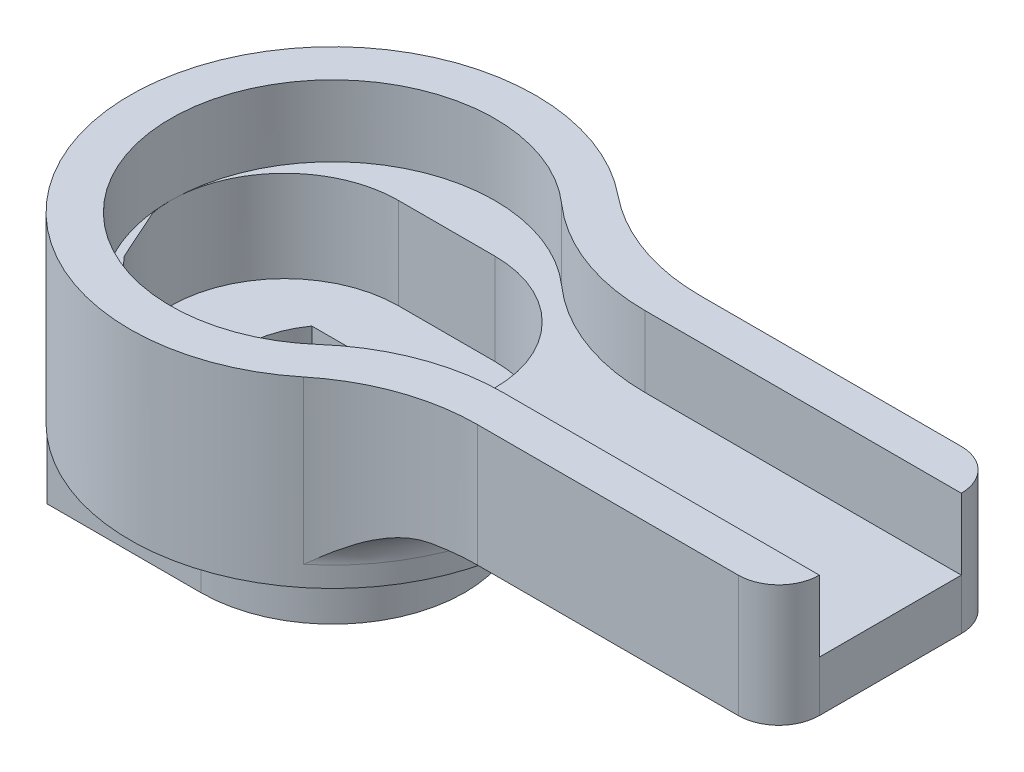
ISO-10303-21;
HEADER;
FILE_DESCRIPTION(('STEP AP214'),'2;1');
FILE_NAME('part.step','',(''),(''),'','','');
FILE_SCHEMA(('AUTOMOTIVE_DESIGN { 1 0 10303 214 1 1 1 1 }'));
ENDSEC;
DATA;
#1=APPLICATION_CONTEXT('core data for automotive mechanical design processes');
#2=APPLICATION_PROTOCOL_DEFINITION('international standard','automotive_design',2000,#1);
#3=PRODUCT_CONTEXT('',#1,'mechanical');
#4=PRODUCT('Part','Part','',(#3));
#5=PRODUCT_RELATED_PRODUCT_CATEGORY('part','',(#4));
#6=PRODUCT_DEFINITION_FORMATION('','',#4);
#7=PRODUCT_DEFINITION_CONTEXT('part definition',#1,'design');
#8=PRODUCT_DEFINITION('design','',#6,#7);
#9=PRODUCT_DEFINITION_SHAPE('','',#8);
#10=(LENGTH_UNIT() NAMED_UNIT(*) SI_UNIT(.MILLI.,.METRE.));
#11=(NAMED_UNIT(*) PLANE_ANGLE_UNIT() SI_UNIT($,.RADIAN.));
#12=(NAMED_UNIT(*) SI_UNIT($,.STERADIAN.) SOLID_ANGLE_UNIT());
#13=UNCERTAINTY_MEASURE_WITH_UNIT(LENGTH_MEASURE(1.E-05),#10,'distance_accuracy_value','');
#14=(GEOMETRIC_REPRESENTATION_CONTEXT(3) GLOBAL_UNCERTAINTY_ASSIGNED_CONTEXT((#13)) GLOBAL_UNIT_ASSIGNED_CONTEXT((#10,
#11,#12)) REPRESENTATION_CONTEXT('',''));
#15=CARTESIAN_POINT('',(0.,0.,0.));
#16=DIRECTION('',(0.,0.,1.));
#17=DIRECTION('',(1.,0.,0.));
#18=AXIS2_PLACEMENT_3D('',#15,#16,#17);
#19=CARTESIAN_POINT('',(0.,8.,0.));
#20=DIRECTION('',(0.,-1.,0.));
#21=DIRECTION('',(0.,0.,-1.));
#22=AXIS2_PLACEMENT_3D('',#19,#20,#21);
#23=CYLINDRICAL_SURFACE('',#22,6.5);
#24=DIRECTION('',(0.,1.,0.));
#25=VECTOR('',#24,1.);
#26=CARTESIAN_POINT('',(0.,-16.4012194668567,-6.5));
#27=LINE('',#26,#25);
#28=CARTESIAN_POINT('',(0.,0.,-6.5));
#29=VERTEX_POINT('',#28);
#30=CARTESIAN_POINT('',(0.,4.,-6.5));
#31=VERTEX_POINT('',#30);
#32=EDGE_CURVE('E250',#29,#31,#27,.T.);
#33=ORIENTED_EDGE('',*,*,#32,.T.);
#34=CARTESIAN_POINT('',(0.,4.,0.));
#35=DIRECTION('',(0.,1.,0.));
#36=DIRECTION('',(0.,0.,1.));
#37=AXIS2_PLACEMENT_3D('',#34,#35,#36);
#38=CIRCLE('',#37,6.5);
#39=CARTESIAN_POINT('',(0.,4.,6.5));
#40=VERTEX_POINT('',#39);
#41=EDGE_CURVE('E362',#40,#31,#38,.T.);
#42=ORIENTED_EDGE('',*,*,#41,.F.);
#43=DIRECTION('',(0.,1.,0.));
#44=VECTOR('',#43,1.);
#45=CARTESIAN_POINT('',(0.,-16.4012194668567,6.5));
#46=LINE('',#45,#44);
#47=CARTESIAN_POINT('',(0.,0.,6.5));
#48=VERTEX_POINT('',#47);
#49=EDGE_CURVE('E242',#48,#40,#46,.T.);
#50=ORIENTED_EDGE('',*,*,#49,.F.);
#51=CARTESIAN_POINT('',(0.,0.,0.));
#52=DIRECTION('',(0.,1.,0.));
#53=DIRECTION('',(0.,0.,1.));
#54=AXIS2_PLACEMENT_3D('',#51,#52,#53);
#55=CIRCLE('',#54,6.5);
#56=EDGE_CURVE('E227',#48,#29,#55,.T.);
#57=ORIENTED_EDGE('',*,*,#56,.T.);
#58=EDGE_LOOP('',(#33,#42,#50,#57));
#59=FACE_BOUND('',#58,.T.);
#60=ADVANCED_FACE('F35',(#59),#23,.T.);
#61=CARTESIAN_POINT('',(0.,4.,0.));
#62=DIRECTION('',(0.,1.,0.));
#63=DIRECTION('',(0.,0.,1.));
#64=AXIS2_PLACEMENT_3D('',#61,#62,#63);
#65=PLANE('',#64);
#66=DIRECTION('',(1.,0.,0.));
#67=VECTOR('',#66,1.);
#68=CARTESIAN_POINT('',(0.,4.,-6.5));
#69=LINE('',#68,#67);
#70=CARTESIAN_POINT('',(-7.59934207678533,4.,-6.5));
#71=VERTEX_POINT('',#70);
#72=EDGE_CURVE('E223',#71,#31,#69,.T.);
#73=ORIENTED_EDGE('',*,*,#72,.F.);
#74=CARTESIAN_POINT('',(0.,4.,0.));
#75=DIRECTION('',(0.,1.,0.));
#76=DIRECTION('',(0.,0.,1.));
#77=AXIS2_PLACEMENT_3D('',#74,#75,#76);
#78=CIRCLE('',#77,10.);
#79=CARTESIAN_POINT('',(-7.59934207678534,4.,6.5));
#80=VERTEX_POINT('',#79);
#81=EDGE_CURVE('E215',#80,#71,#78,.T.);
#82=ORIENTED_EDGE('',*,*,#81,.F.);
#83=DIRECTION('',(-1.,0.,0.));
#84=VECTOR('',#83,1.);
#85=CARTESIAN_POINT('',(0.,4.,6.5));
#86=LINE('',#85,#84);
#87=EDGE_CURVE('E220',#40,#80,#86,.T.);
#88=ORIENTED_EDGE('',*,*,#87,.F.);
#89=ORIENTED_EDGE('',*,*,#41,.T.);
#90=EDGE_LOOP('',(#73,#82,#88,#89));
#91=FACE_BOUND('',#90,.T.);
#92=ADVANCED_FACE('F217',(#91),#65,.F.);
#93=CARTESIAN_POINT('',(-5.03818391404763,8.,-2.625));
#94=DIRECTION('',(0.,0.,-1.));
#95=DIRECTION('',(-1.,0.,0.));
#96=AXIS2_PLACEMENT_3D('',#93,#94,#95);
#97=PLANE('',#96);
#98=DIRECTION('',(1.,0.,0.));
#99=VECTOR('',#98,1.);
#100=CARTESIAN_POINT('',(-5.03818391404763,5.,-2.625));
#101=LINE('',#100,#99);
#102=CARTESIAN_POINT('',(-3.65504787930336,5.,-2.625));
#103=VERTEX_POINT('',#102);
#104=CARTESIAN_POINT('',(3.65504787930336,5.,-2.625));
#105=VERTEX_POINT('',#104);
#106=EDGE_CURVE('E286',#103,#105,#101,.T.);
#107=ORIENTED_EDGE('',*,*,#106,.F.);
#108=DIRECTION('',(0.,-1.,0.));
#109=VECTOR('',#108,1.);
#110=CARTESIAN_POINT('',(-3.65504787930336,8.001,-2.625));
#111=LINE('',#110,#109);
#112=CARTESIAN_POINT('',(-3.65504787930336,0.,-2.625));
#113=VERTEX_POINT('',#112);
#114=EDGE_CURVE('E364',#113,#103,#111,.F.);
#115=ORIENTED_EDGE('',*,*,#114,.F.);
#116=DIRECTION('',(1.,0.,0.));
#117=VECTOR('',#116,1.);
#118=CARTESIAN_POINT('',(-5.03818391404763,0.,-2.625));
#119=LINE('',#118,#117);
#120=CARTESIAN_POINT('',(3.65504787930336,0.,-2.625));
#121=VERTEX_POINT('',#120);
#122=EDGE_CURVE('E351',#113,#121,#119,.T.);
#123=ORIENTED_EDGE('',*,*,#122,.T.);
#124=DIRECTION('',(0.,-1.,0.));
#125=VECTOR('',#124,1.);
#126=CARTESIAN_POINT('',(3.65504787930336,8.001,-2.625));
#127=LINE('',#126,#125);
#128=EDGE_CURVE('E367',#105,#121,#127,.T.);
#129=ORIENTED_EDGE('',*,*,#128,.F.);
#130=EDGE_LOOP('',(#107,#115,#123,#129));
#131=FACE_BOUND('',#130,.T.);
#132=ADVANCED_FACE('F473',(#131),#97,.F.);
#133=CARTESIAN_POINT('',(-5.03818391404763,8.,2.625));
#134=DIRECTION('',(0.,0.,1.));
#135=DIRECTION('',(1.,0.,0.));
#136=AXIS2_PLACEMENT_3D('',#133,#134,#135);
#137=PLANE('',#136);
#138=DIRECTION('',(-1.,0.,0.));
#139=VECTOR('',#138,1.);
#140=CARTESIAN_POINT('',(-5.03818391404763,5.,2.625));
#141=LINE('',#140,#139);
#142=CARTESIAN_POINT('',(3.65504787930336,5.,2.625));
#143=VERTEX_POINT('',#142);
#144=CARTESIAN_POINT('',(-3.65504787930336,5.,2.625));
#145=VERTEX_POINT('',#144);
#146=EDGE_CURVE('E279',#143,#145,#141,.T.);
#147=ORIENTED_EDGE('',*,*,#146,.F.);
#148=DIRECTION('',(0.,-1.,0.));
#149=VECTOR('',#148,1.);
#150=CARTESIAN_POINT('',(3.65504787930336,8.001,2.625));
#151=LINE('',#150,#149);
#152=CARTESIAN_POINT('',(3.65504787930336,0.,2.625));
#153=VERTEX_POINT('',#152);
#154=EDGE_CURVE('E345',#153,#143,#151,.F.);
#155=ORIENTED_EDGE('',*,*,#154,.F.);
#156=DIRECTION('',(-1.,0.,0.));
#157=VECTOR('',#156,1.);
#158=CARTESIAN_POINT('',(-5.03818391404763,0.,2.625));
#159=LINE('',#158,#157);
#160=CARTESIAN_POINT('',(-3.65504787930336,0.,2.625));
#161=VERTEX_POINT('',#160);
#162=EDGE_CURVE('E343',#153,#161,#159,.T.);
#163=ORIENTED_EDGE('',*,*,#162,.T.);
#164=DIRECTION('',(0.,-1.,0.));
#165=VECTOR('',#164,1.);
#166=CARTESIAN_POINT('',(-3.65504787930336,8.001,2.625));
#167=LINE('',#166,#165);
#168=EDGE_CURVE('E348',#145,#161,#167,.T.);
#169=ORIENTED_EDGE('',*,*,#168,.F.);
#170=EDGE_LOOP('',(#147,#155,#163,#169));
#171=FACE_BOUND('',#170,.T.);
#172=ADVANCED_FACE('F495',(#171),#137,.F.);
#173=CARTESIAN_POINT('',(0.,5.,0.));
#174=DIRECTION('',(0.,1.,0.));
#175=DIRECTION('',(0.,0.,1.));
#176=AXIS2_PLACEMENT_3D('',#173,#174,#175);
#177=PLANE('',#176);
#178=ORIENTED_EDGE('',*,*,#106,.T.);
#179=CARTESIAN_POINT('',(0.,5.,0.));
#180=DIRECTION('',(0.,1.,0.));
#181=DIRECTION('',(0.,0.,1.));
#182=AXIS2_PLACEMENT_3D('',#179,#180,#181);
#183=CIRCLE('',#182,4.5);
#184=EDGE_CURVE('E358',#143,#105,#183,.T.);
#185=ORIENTED_EDGE('',*,*,#184,.F.);
#186=ORIENTED_EDGE('',*,*,#146,.T.);
#187=EDGE_CURVE('E228',#103,#145,#183,.T.);
#188=ORIENTED_EDGE('',*,*,#187,.F.);
#189=EDGE_LOOP('',(#178,#185,#186,#188));
#190=FACE_BOUND('',#189,.T.);
#191=CARTESIAN_POINT('',(-2.375,5.,0.));
#192=DIRECTION('',(0.,1.,0.));
#193=DIRECTION('',(0.,0.,1.));
#194=AXIS2_PLACEMENT_3D('',#191,#192,#193);
#195=CIRCLE('',#194,5.625);
#196=CARTESIAN_POINT('',(-2.375,5.,-5.625));
#197=VERTEX_POINT('',#196);
#198=CARTESIAN_POINT('',(-2.375,5.,5.625));
#199=VERTEX_POINT('',#198);
#200=EDGE_CURVE('E253',#197,#199,#195,.T.);
#201=ORIENTED_EDGE('',*,*,#200,.T.);
#202=DIRECTION('',(1.,0.,0.));
#203=VECTOR('',#202,1.);
#204=CARTESIAN_POINT('',(-2.375,5.,5.625));
#205=LINE('',#204,#203);
#206=CARTESIAN_POINT('',(2.375,5.,5.625));
#207=VERTEX_POINT('',#206);
#208=EDGE_CURVE('E256',#199,#207,#205,.T.);
#209=ORIENTED_EDGE('',*,*,#208,.T.);
#210=CARTESIAN_POINT('',(2.375,5.,0.));
#211=DIRECTION('',(0.,1.,0.));
#212=DIRECTION('',(0.,0.,1.));
#213=AXIS2_PLACEMENT_3D('',#210,#211,#212);
#214=CIRCLE('',#213,5.625);
#215=CARTESIAN_POINT('',(2.375,5.,-5.625));
#216=VERTEX_POINT('',#215);
#217=EDGE_CURVE('E260',#207,#216,#214,.T.);
#218=ORIENTED_EDGE('',*,*,#217,.T.);
#219=DIRECTION('',(-1.,0.,0.));
#220=VECTOR('',#219,1.);
#221=CARTESIAN_POINT('',(-2.375,5.,-5.625));
#222=LINE('',#221,#220);
#223=EDGE_CURVE('E263',#216,#197,#222,.T.);
#224=ORIENTED_EDGE('',*,*,#223,.T.);
#225=EDGE_LOOP('',(#201,#209,#218,#224));
#226=FACE_BOUND('',#225,.T.);
#227=ADVANCED_FACE('F503',(#190,#226),#177,.T.);
#228=CARTESIAN_POINT('',(0.,8.001,0.));
#229=DIRECTION('',(0.,-1.,0.));
#230=DIRECTION('',(0.,0.,-1.));
#231=AXIS2_PLACEMENT_3D('',#228,#229,#230);
#232=CYLINDRICAL_SURFACE('',#231,4.5);
#233=ORIENTED_EDGE('',*,*,#187,.T.);
#234=ORIENTED_EDGE('',*,*,#168,.T.);
#235=CARTESIAN_POINT('',(0.,0.,0.));
#236=DIRECTION('',(0.,1.,0.));
#237=DIRECTION('',(0.,0.,1.));
#238=AXIS2_PLACEMENT_3D('',#235,#236,#237);
#239=CIRCLE('',#238,4.5);
#240=EDGE_CURVE('E355',#113,#161,#239,.T.);
#241=ORIENTED_EDGE('',*,*,#240,.F.);
#242=ORIENTED_EDGE('',*,*,#114,.T.);
#243=EDGE_LOOP('',(#233,#234,#241,#242));
#244=FACE_BOUND('',#243,.T.);
#245=ADVANCED_FACE('F491',(#244),#232,.F.);
#246=EDGE_CURVE('E354',#153,#121,#239,.T.);
#247=ORIENTED_EDGE('',*,*,#246,.F.);
#248=ORIENTED_EDGE('',*,*,#154,.T.);
#249=ORIENTED_EDGE('',*,*,#184,.T.);
#250=ORIENTED_EDGE('',*,*,#128,.T.);
#251=EDGE_LOOP('',(#247,#248,#249,#250));
#252=FACE_BOUND('',#251,.T.);
#253=ADVANCED_FACE('F486',(#252),#232,.F.);
#254=CARTESIAN_POINT('',(0.,0.,0.));
#255=DIRECTION('',(0.,1.,0.));
#256=DIRECTION('',(0.,0.,1.));
#257=AXIS2_PLACEMENT_3D('',#254,#255,#256);
#258=PLANE('',#257);
#259=ORIENTED_EDGE('',*,*,#56,.F.);
#260=DIRECTION('',(1.,0.,0.));
#261=VECTOR('',#260,1.);
#262=CARTESIAN_POINT('',(0.,0.,6.5));
#263=LINE('',#262,#261);
#264=CARTESIAN_POINT('',(-7.59934207678534,0.,6.5));
#265=VERTEX_POINT('',#264);
#266=EDGE_CURVE('E246',#265,#48,#263,.T.);
#267=ORIENTED_EDGE('',*,*,#266,.F.);
#268=CARTESIAN_POINT('',(0.,0.,0.));
#269=DIRECTION('',(0.,1.,0.));
#270=DIRECTION('',(0.,0.,1.));
#271=AXIS2_PLACEMENT_3D('',#268,#269,#270);
#272=CIRCLE('',#271,10.);
#273=CARTESIAN_POINT('',(-7.59934207678533,0.,-6.5));
#274=VERTEX_POINT('',#273);
#275=EDGE_CURVE('E234',#274,#265,#272,.T.);
#276=ORIENTED_EDGE('',*,*,#275,.F.);
#277=DIRECTION('',(-1.,0.,0.));
#278=VECTOR('',#277,1.);
#279=CARTESIAN_POINT('',(0.,0.,-6.5));
#280=LINE('',#279,#278);
#281=EDGE_CURVE('E237',#29,#274,#280,.T.);
#282=ORIENTED_EDGE('',*,*,#281,.F.);
#283=EDGE_LOOP('',(#259,#267,#276,#282));
#284=FACE_BOUND('',#283,.T.);
#285=ORIENTED_EDGE('',*,*,#240,.T.);
#286=ORIENTED_EDGE('',*,*,#162,.F.);
#287=ORIENTED_EDGE('',*,*,#246,.T.);
#288=ORIENTED_EDGE('',*,*,#122,.F.);
#289=EDGE_LOOP('',(#285,#286,#287,#288));
#290=FACE_BOUND('',#289,.T.);
#291=ADVANCED_FACE('F483',(#284,#290),#258,.F.);
#292=CARTESIAN_POINT('',(0.,4.,0.));
#293=DIRECTION('',(0.,1.,0.));
#294=DIRECTION('',(0.,0.,1.));
#295=AXIS2_PLACEMENT_3D('',#292,#293,#294);
#296=CYLINDRICAL_SURFACE('',#295,10.);
#297=CARTESIAN_POINT('',(0.,5.,0.));
#298=DIRECTION('',(0.,1.,0.));
#299=DIRECTION('',(0.,0.,1.));
#300=AXIS2_PLACEMENT_3D('',#297,#298,#299);
#301=CIRCLE('',#300,10.);
#302=CARTESIAN_POINT('',(6.31961232988227,5.,-7.75));
#303=VERTEX_POINT('',#302);
#304=CARTESIAN_POINT('',(6.31961232988227,5.,7.75));
#305=VERTEX_POINT('',#304);
#306=EDGE_CURVE('E427',#303,#305,#301,.F.);
#307=ORIENTED_EDGE('',*,*,#306,.T.);
#308=DIRECTION('',(0.,1.,0.));
#309=VECTOR('',#308,1.);
#310=CARTESIAN_POINT('',(6.31961232988227,4.,7.75));
#311=LINE('',#310,#309);
#312=CARTESIAN_POINT('',(6.31961232988227,13.,7.75));
#313=VERTEX_POINT('',#312);
#314=EDGE_CURVE('E375',#305,#313,#311,.T.);
#315=ORIENTED_EDGE('',*,*,#314,.T.);
#316=CARTESIAN_POINT('',(0.,13.,0.));
#317=DIRECTION('',(0.,1.,0.));
#318=DIRECTION('',(0.,0.,1.));
#319=AXIS2_PLACEMENT_3D('',#316,#317,#318);
#320=CIRCLE('',#319,10.);
#321=CARTESIAN_POINT('',(6.31961232988227,13.,-7.75));
#322=VERTEX_POINT('',#321);
#323=EDGE_CURVE('E337',#322,#313,#320,.T.);
#324=ORIENTED_EDGE('',*,*,#323,.F.);
#325=DIRECTION('',(0.,1.,0.));
#326=VECTOR('',#325,1.);
#327=CARTESIAN_POINT('',(6.31961232988227,4.,-7.75));
#328=LINE('',#327,#326);
#329=EDGE_CURVE('E373',#322,#303,#328,.F.);
#330=ORIENTED_EDGE('',*,*,#329,.T.);
#331=EDGE_LOOP('',(#307,#315,#324,#330));
#332=FACE_BOUND('',#331,.T.);
#333=ORIENTED_EDGE('',*,*,#81,.T.);
#334=DIRECTION('',(0.,1.,0.));
#335=VECTOR('',#334,1.);
#336=CARTESIAN_POINT('',(-7.59934207678533,-16.4012194668567,-6.5));
#337=LINE('',#336,#335);
#338=EDGE_CURVE('E238',#274,#71,#337,.T.);
#339=ORIENTED_EDGE('',*,*,#338,.F.);
#340=ORIENTED_EDGE('',*,*,#275,.T.);
#341=DIRECTION('',(0.,1.,0.));
#342=VECTOR('',#341,1.);
#343=CARTESIAN_POINT('',(-7.59934207678534,-16.4012194668567,6.5));
#344=LINE('',#343,#342);
#345=EDGE_CURVE('E232',#265,#80,#344,.T.);
#346=ORIENTED_EDGE('',*,*,#345,.T.);
#347=EDGE_LOOP('',(#333,#339,#340,#346));
#348=FACE_BOUND('',#347,.T.);
#349=ADVANCED_FACE('F233',(#332,#348),#296,.T.);
#350=CARTESIAN_POINT('',(0.,13.,0.));
#351=DIRECTION('',(0.,1.,0.));
#352=DIRECTION('',(0.,0.,1.));
#353=AXIS2_PLACEMENT_3D('',#350,#351,#352);
#354=PLANE('',#353);
#355=DIRECTION('',(1.,0.,0.));
#356=VECTOR('',#355,1.);
#357=CARTESIAN_POINT('',(27.5,13.,5.5));
#358=LINE('',#357,#356);
#359=CARTESIAN_POINT('',(12.6392246597645,13.,5.5));
#360=VERTEX_POINT('',#359);
#361=CARTESIAN_POINT('',(25.5,13.,5.5));
#362=VERTEX_POINT('',#361);
#363=EDGE_CURVE('E331',#360,#362,#358,.T.);
#364=ORIENTED_EDGE('',*,*,#363,.T.);
#365=CARTESIAN_POINT('',(25.5,13.,3.5));
#366=DIRECTION('',(0.,1.,0.));
#367=DIRECTION('',(0.,0.,1.));
#368=AXIS2_PLACEMENT_3D('',#365,#366,#367);
#369=CIRCLE('',#368,2.);
#370=CARTESIAN_POINT('',(27.5,13.,3.5));
#371=VERTEX_POINT('',#370);
#372=EDGE_CURVE('E411',#362,#371,#369,.T.);
#373=ORIENTED_EDGE('',*,*,#372,.T.);
#374=DIRECTION('',(1.,0.,0.));
#375=VECTOR('',#374,1.);
#376=CARTESIAN_POINT('',(29.1728965287241,13.,3.5));
#377=LINE('',#376,#375);
#378=CARTESIAN_POINT('',(11.9058808997907,13.,3.5));
#379=VERTEX_POINT('',#378);
#380=EDGE_CURVE('E305',#379,#371,#377,.T.);
#381=ORIENTED_EDGE('',*,*,#380,.F.);
#382=CARTESIAN_POINT('',(11.9058808997907,13.,13.5));
#383=DIRECTION('',(0.,1.,0.));
#384=DIRECTION('',(0.,0.,1.));
#385=AXIS2_PLACEMENT_3D('',#382,#383,#384);
#386=CIRCLE('',#385,10.);
#387=CARTESIAN_POINT('',(5.29150262212918,13.,6.));
#388=VERTEX_POINT('',#387);
#389=EDGE_CURVE('E390',#379,#388,#386,.T.);
#390=ORIENTED_EDGE('',*,*,#389,.T.);
#391=CARTESIAN_POINT('',(0.,13.,0.));
#392=DIRECTION('',(0.,1.,0.));
#393=DIRECTION('',(0.,0.,1.));
#394=AXIS2_PLACEMENT_3D('',#391,#392,#393);
#395=CIRCLE('',#394,8.);
#396=CARTESIAN_POINT('',(5.29150262212918,13.,-6.));
#397=VERTEX_POINT('',#396);
#398=EDGE_CURVE('E319',#397,#388,#395,.T.);
#399=ORIENTED_EDGE('',*,*,#398,.F.);
#400=CARTESIAN_POINT('',(11.9058808997907,13.,-13.5));
#401=DIRECTION('',(0.,1.,0.));
#402=DIRECTION('',(0.,0.,1.));
#403=AXIS2_PLACEMENT_3D('',#400,#401,#402);
#404=CIRCLE('',#403,10.);
#405=CARTESIAN_POINT('',(11.9058808997907,13.,-3.5));
#406=VERTEX_POINT('',#405);
#407=EDGE_CURVE('E388',#397,#406,#404,.T.);
#408=ORIENTED_EDGE('',*,*,#407,.T.);
#409=DIRECTION('',(-1.,0.,0.));
#410=VECTOR('',#409,1.);
#411=CARTESIAN_POINT('',(29.1728965287241,13.,-3.5));
#412=LINE('',#411,#410);
#413=CARTESIAN_POINT('',(27.5,13.,-3.5));
#414=VERTEX_POINT('',#413);
#415=EDGE_CURVE('E296',#414,#406,#412,.T.);
#416=ORIENTED_EDGE('',*,*,#415,.F.);
#417=CARTESIAN_POINT('',(25.5,13.,-3.5));
#418=DIRECTION('',(0.,1.,0.));
#419=DIRECTION('',(0.,0.,1.));
#420=AXIS2_PLACEMENT_3D('',#417,#418,#419);
#421=CIRCLE('',#420,2.);
#422=CARTESIAN_POINT('',(25.5,13.,-5.5));
#423=VERTEX_POINT('',#422);
#424=EDGE_CURVE('E409',#414,#423,#421,.T.);
#425=ORIENTED_EDGE('',*,*,#424,.T.);
#426=DIRECTION('',(-1.,0.,0.));
#427=VECTOR('',#426,1.);
#428=CARTESIAN_POINT('',(27.5,13.,-5.5));
#429=LINE('',#428,#427);
#430=CARTESIAN_POINT('',(12.6392246597645,13.,-5.5));
#431=VERTEX_POINT('',#430);
#432=EDGE_CURVE('E323',#423,#431,#429,.T.);
#433=ORIENTED_EDGE('',*,*,#432,.T.);
#434=CARTESIAN_POINT('',(12.6392246597645,13.,-15.5));
#435=DIRECTION('',(0.,1.,0.));
#436=DIRECTION('',(0.,0.,1.));
#437=AXIS2_PLACEMENT_3D('',#434,#435,#436);
#438=CIRCLE('',#437,10.);
#439=EDGE_CURVE('E398',#431,#322,#438,.F.);
#440=ORIENTED_EDGE('',*,*,#439,.T.);
#441=ORIENTED_EDGE('',*,*,#323,.T.);
#442=CARTESIAN_POINT('',(12.6392246597645,13.,15.5));
#443=DIRECTION('',(0.,1.,0.));
#444=DIRECTION('',(0.,0.,1.));
#445=AXIS2_PLACEMENT_3D('',#442,#443,#444);
#446=CIRCLE('',#445,10.);
#447=EDGE_CURVE('E396',#313,#360,#446,.F.);
#448=ORIENTED_EDGE('',*,*,#447,.T.);
#449=EDGE_LOOP('',(#364,#373,#381,#390,#399,#408,#416,#425,#433,#440,#441,#448));
#450=FACE_BOUND('',#449,.T.);
#451=ADVANCED_FACE('F574',(#450),#354,.T.);
#452=CARTESIAN_POINT('',(27.5,7.,5.5));
#453=DIRECTION('',(1.,0.,0.));
#454=DIRECTION('',(0.,0.,-1.));
#455=AXIS2_PLACEMENT_3D('',#452,#453,#454);
#456=PLANE('',#455);
#457=DIRECTION('',(0.,0.,1.));
#458=VECTOR('',#457,1.);
#459=CARTESIAN_POINT('',(27.5,9.5,5.5));
#460=LINE('',#459,#458);
#461=CARTESIAN_POINT('',(27.5,9.5,-3.5));
#462=VERTEX_POINT('',#461);
#463=CARTESIAN_POINT('',(27.5,9.5,3.5));
#464=VERTEX_POINT('',#463);
#465=EDGE_CURVE('E316',#462,#464,#460,.T.);
#466=ORIENTED_EDGE('',*,*,#465,.T.);
#467=DIRECTION('',(0.,1.,0.));
#468=VECTOR('',#467,1.);
#469=CARTESIAN_POINT('',(27.5,7.,3.5));
#470=LINE('',#469,#468);
#471=CARTESIAN_POINT('',(27.5,7.,3.5));
#472=VERTEX_POINT('',#471);
#473=EDGE_CURVE('E416',#464,#472,#470,.F.);
#474=ORIENTED_EDGE('',*,*,#473,.T.);
#475=DIRECTION('',(0.,0.,-1.));
#476=VECTOR('',#475,1.);
#477=CARTESIAN_POINT('',(27.5,7.,5.5));
#478=LINE('',#477,#476);
#479=CARTESIAN_POINT('',(27.5,7.,-3.5));
#480=VERTEX_POINT('',#479);
#481=EDGE_CURVE('E327',#472,#480,#478,.T.);
#482=ORIENTED_EDGE('',*,*,#481,.T.);
#483=DIRECTION('',(0.,1.,0.));
#484=VECTOR('',#483,1.);
#485=CARTESIAN_POINT('',(27.5,7.,-3.5));
#486=LINE('',#485,#484);
#487=EDGE_CURVE('E413',#480,#462,#486,.T.);
#488=ORIENTED_EDGE('',*,*,#487,.T.);
#489=EDGE_LOOP('',(#466,#474,#482,#488));
#490=FACE_BOUND('',#489,.T.);
#491=ADVANCED_FACE('F545',(#490),#456,.T.);
#492=CARTESIAN_POINT('',(27.5,7.,5.5));
#493=DIRECTION('',(0.,0.,1.));
#494=DIRECTION('',(1.,0.,0.));
#495=AXIS2_PLACEMENT_3D('',#492,#493,#494);
#496=PLANE('',#495);
#497=DIRECTION('',(1.,0.,0.));
#498=VECTOR('',#497,1.);
#499=CARTESIAN_POINT('',(27.5,7.,5.5));
#500=LINE('',#499,#498);
#501=CARTESIAN_POINT('',(12.6392246597645,7.,5.5));
#502=VERTEX_POINT('',#501);
#503=CARTESIAN_POINT('',(25.5,7.,5.5));
#504=VERTEX_POINT('',#503);
#505=EDGE_CURVE('E334',#502,#504,#500,.T.);
#506=ORIENTED_EDGE('',*,*,#505,.T.);
#507=DIRECTION('',(0.,1.,0.));
#508=VECTOR('',#507,1.);
#509=CARTESIAN_POINT('',(25.5,7.,5.5));
#510=LINE('',#509,#508);
#511=EDGE_CURVE('E406',#504,#362,#510,.T.);
#512=ORIENTED_EDGE('',*,*,#511,.T.);
#513=ORIENTED_EDGE('',*,*,#363,.F.);
#514=DIRECTION('',(0.,-1.,0.));
#515=VECTOR('',#514,1.);
#516=CARTESIAN_POINT('',(12.6392246597645,7.,5.5));
#517=LINE('',#516,#515);
#518=EDGE_CURVE('E370',#360,#502,#517,.T.);
#519=ORIENTED_EDGE('',*,*,#518,.T.);
#520=EDGE_LOOP('',(#506,#512,#513,#519));
#521=FACE_BOUND('',#520,.T.);
#522=ADVANCED_FACE('F554',(#521),#496,.T.);
#523=CARTESIAN_POINT('',(27.5,7.,-5.5));
#524=DIRECTION('',(0.,0.,-1.));
#525=DIRECTION('',(-1.,0.,0.));
#526=AXIS2_PLACEMENT_3D('',#523,#524,#525);
#527=PLANE('',#526);
#528=ORIENTED_EDGE('',*,*,#432,.F.);
#529=DIRECTION('',(0.,1.,0.));
#530=VECTOR('',#529,1.);
#531=CARTESIAN_POINT('',(25.5,7.,-5.5));
#532=LINE('',#531,#530);
#533=CARTESIAN_POINT('',(25.5,7.,-5.5));
#534=VERTEX_POINT('',#533);
#535=EDGE_CURVE('E422',#423,#534,#532,.F.);
#536=ORIENTED_EDGE('',*,*,#535,.T.);
#537=DIRECTION('',(-1.,0.,0.));
#538=VECTOR('',#537,1.);
#539=CARTESIAN_POINT('',(27.5,7.,-5.5));
#540=LINE('',#539,#538);
#541=CARTESIAN_POINT('',(12.6392246597645,7.,-5.5));
#542=VERTEX_POINT('',#541);
#543=EDGE_CURVE('E330',#534,#542,#540,.T.);
#544=ORIENTED_EDGE('',*,*,#543,.T.);
#545=DIRECTION('',(0.,-1.,0.));
#546=VECTOR('',#545,1.);
#547=CARTESIAN_POINT('',(12.6392246597645,13.,-5.5));
#548=LINE('',#547,#546);
#549=EDGE_CURVE('E377',#542,#431,#548,.F.);
#550=ORIENTED_EDGE('',*,*,#549,.T.);
#551=EDGE_LOOP('',(#528,#536,#544,#550));
#552=FACE_BOUND('',#551,.T.);
#553=ADVANCED_FACE('F567',(#552),#527,.T.);
#554=CARTESIAN_POINT('',(0.,7.,0.));
#555=DIRECTION('',(0.,1.,0.));
#556=DIRECTION('',(0.,0.,1.));
#557=AXIS2_PLACEMENT_3D('',#554,#555,#556);
#558=PLANE('',#557);
#559=CARTESIAN_POINT('',(20.,7.,0.));
#560=DIRECTION('',(0.,1.,0.));
#561=DIRECTION('',(0.,0.,1.));
#562=AXIS2_PLACEMENT_3D('',#559,#560,#561);
#563=CIRCLE('',#562,1.5);
#564=CARTESIAN_POINT('',(20.,7.,1.5));
#565=VERTEX_POINT('',#564);
#566=EDGE_CURVE('E292',#565,#565,#563,.F.);
#567=ORIENTED_EDGE('',*,*,#566,.F.);
#568=EDGE_LOOP('',(#567));
#569=FACE_BOUND('',#568,.T.);
#570=CARTESIAN_POINT('',(24.,7.,0.));
#571=DIRECTION('',(0.,1.,0.));
#572=DIRECTION('',(0.,0.,1.));
#573=AXIS2_PLACEMENT_3D('',#570,#571,#572);
#574=CIRCLE('',#573,1.5);
#575=CARTESIAN_POINT('',(24.,7.,1.5));
#576=VERTEX_POINT('',#575);
#577=EDGE_CURVE('E293',#576,#576,#574,.F.);
#578=ORIENTED_EDGE('',*,*,#577,.F.);
#579=EDGE_LOOP('',(#578));
#580=FACE_BOUND('',#579,.T.);
#581=CARTESIAN_POINT('',(12.6392246597645,7.,15.5));
#582=DIRECTION('',(0.,1.,0.));
#583=DIRECTION('',(0.,0.,1.));
#584=AXIS2_PLACEMENT_3D('',#581,#582,#583);
#585=CIRCLE('',#584,10.);
#586=CARTESIAN_POINT('',(10.5484637518745,7.,5.72100624675326));
#587=VERTEX_POINT('',#586);
#588=EDGE_CURVE('E394',#502,#587,#585,.T.);
#589=ORIENTED_EDGE('',*,*,#588,.T.);
#590=CARTESIAN_POINT('',(0.,7.,0.));
#591=DIRECTION('',(0.,1.,0.));
#592=DIRECTION('',(0.,0.,1.));
#593=AXIS2_PLACEMENT_3D('',#590,#591,#592);
#594=CIRCLE('',#593,12.);
#595=CARTESIAN_POINT('',(10.5484637518745,7.,-5.72100624675326));
#596=VERTEX_POINT('',#595);
#597=EDGE_CURVE('E56',#587,#596,#594,.T.);
#598=ORIENTED_EDGE('',*,*,#597,.T.);
#599=CARTESIAN_POINT('',(12.6392246597645,7.,-15.5));
#600=DIRECTION('',(0.,1.,0.));
#601=DIRECTION('',(0.,0.,1.));
#602=AXIS2_PLACEMENT_3D('',#599,#600,#601);
#603=CIRCLE('',#602,10.);
#604=EDGE_CURVE('E400',#596,#542,#603,.T.);
#605=ORIENTED_EDGE('',*,*,#604,.T.);
#606=ORIENTED_EDGE('',*,*,#543,.F.);
#607=CARTESIAN_POINT('',(25.5,7.,-3.5));
#608=DIRECTION('',(0.,1.,0.));
#609=DIRECTION('',(0.,0.,1.));
#610=AXIS2_PLACEMENT_3D('',#607,#608,#609);
#611=CIRCLE('',#610,2.);
#612=EDGE_CURVE('E418',#534,#480,#611,.F.);
#613=ORIENTED_EDGE('',*,*,#612,.T.);
#614=ORIENTED_EDGE('',*,*,#481,.F.);
#615=CARTESIAN_POINT('',(25.5,7.,3.5));
#616=DIRECTION('',(0.,1.,0.));
#617=DIRECTION('',(0.,0.,1.));
#618=AXIS2_PLACEMENT_3D('',#615,#616,#617);
#619=CIRCLE('',#618,2.);
#620=EDGE_CURVE('E420',#472,#504,#619,.F.);
#621=ORIENTED_EDGE('',*,*,#620,.T.);
#622=ORIENTED_EDGE('',*,*,#505,.F.);
#623=EDGE_LOOP('',(#589,#598,#605,#606,#613,#614,#621,#622));
#624=FACE_BOUND('',#623,.T.);
#625=ADVANCED_FACE('F552',(#569,#580,#624),#558,.F.);
#626=CARTESIAN_POINT('',(0.,9.5,0.));
#627=DIRECTION('',(0.,1.,0.));
#628=DIRECTION('',(0.,0.,1.));
#629=AXIS2_PLACEMENT_3D('',#626,#627,#628);
#630=CYLINDRICAL_SURFACE('',#629,8.);
#631=ORIENTED_EDGE('',*,*,#398,.T.);
#632=DIRECTION('',(0.,1.,0.));
#633=VECTOR('',#632,1.);
#634=CARTESIAN_POINT('',(5.29150262212918,9.5,6.));
#635=LINE('',#634,#633);
#636=CARTESIAN_POINT('',(5.29150262212918,9.5,6.));
#637=VERTEX_POINT('',#636);
#638=EDGE_CURVE('E383',#388,#637,#635,.F.);
#639=ORIENTED_EDGE('',*,*,#638,.T.);
#640=CARTESIAN_POINT('',(0.,9.5,0.));
#641=DIRECTION('',(0.,1.,0.));
#642=DIRECTION('',(0.,0.,1.));
#643=AXIS2_PLACEMENT_3D('',#640,#641,#642);
#644=CIRCLE('',#643,8.);
#645=CARTESIAN_POINT('',(-8.,9.5,0.));
#646=VERTEX_POINT('',#645);
#647=EDGE_CURVE('E324',#646,#637,#644,.T.);
#648=ORIENTED_EDGE('',*,*,#647,.F.);
#649=CARTESIAN_POINT('',(5.29150262212918,9.5,-6.));
#650=VERTEX_POINT('',#649);
#651=EDGE_CURVE('E320',#650,#646,#644,.T.);
#652=ORIENTED_EDGE('',*,*,#651,.F.);
#653=DIRECTION('',(0.,1.,0.));
#654=VECTOR('',#653,1.);
#655=CARTESIAN_POINT('',(5.29150262212918,9.5,-6.));
#656=LINE('',#655,#654);
#657=EDGE_CURVE('E380',#650,#397,#656,.T.);
#658=ORIENTED_EDGE('',*,*,#657,.T.);
#659=EDGE_LOOP('',(#631,#639,#648,#652,#658));
#660=FACE_BOUND('',#659,.T.);
#661=ADVANCED_FACE('F531',(#660),#630,.F.);
#662=CARTESIAN_POINT('',(0.,9.5,0.));
#663=DIRECTION('',(0.,1.,0.));
#664=DIRECTION('',(0.,0.,1.));
#665=AXIS2_PLACEMENT_3D('',#662,#663,#664);
#666=PLANE('',#665);
#667=CARTESIAN_POINT('',(-2.375,9.5,0.));
#668=DIRECTION('',(0.,1.,0.));
#669=DIRECTION('',(0.,0.,1.));
#670=AXIS2_PLACEMENT_3D('',#667,#668,#669);
#671=CIRCLE('',#670,5.625);
#672=CARTESIAN_POINT('',(-2.375,9.5,-5.625));
#673=VERTEX_POINT('',#672);
#674=EDGE_CURVE('E267',#673,#646,#671,.T.);
#675=ORIENTED_EDGE('',*,*,#674,.F.);
#676=DIRECTION('',(-1.,0.,0.));
#677=VECTOR('',#676,1.);
#678=CARTESIAN_POINT('',(-2.375,9.5,-5.625));
#679=LINE('',#678,#677);
#680=CARTESIAN_POINT('',(2.375,9.5,-5.625));
#681=VERTEX_POINT('',#680);
#682=EDGE_CURVE('E257',#681,#673,#679,.T.);
#683=ORIENTED_EDGE('',*,*,#682,.F.);
#684=CARTESIAN_POINT('',(2.375,9.5,0.));
#685=DIRECTION('',(0.,1.,0.));
#686=DIRECTION('',(0.,0.,1.));
#687=AXIS2_PLACEMENT_3D('',#684,#685,#686);
#688=CIRCLE('',#687,5.625);
#689=CARTESIAN_POINT('',(2.375,9.5,5.625));
#690=VERTEX_POINT('',#689);
#691=EDGE_CURVE('E272',#690,#681,#688,.T.);
#692=ORIENTED_EDGE('',*,*,#691,.F.);
#693=DIRECTION('',(1.,0.,0.));
#694=VECTOR('',#693,1.);
#695=CARTESIAN_POINT('',(-2.375,9.5,5.625));
#696=LINE('',#695,#694);
#697=CARTESIAN_POINT('',(-2.375,9.5,5.625));
#698=VERTEX_POINT('',#697);
#699=EDGE_CURVE('E269',#698,#690,#696,.T.);
#700=ORIENTED_EDGE('',*,*,#699,.F.);
#701=CARTESIAN_POINT('',(-2.375,9.5,0.));
#702=DIRECTION('',(0.,1.,0.));
#703=DIRECTION('',(0.,0.,1.));
#704=AXIS2_PLACEMENT_3D('',#701,#702,#703);
#705=CIRCLE('',#704,5.625);
#706=EDGE_CURVE('E424',#646,#698,#705,.T.);
#707=ORIENTED_EDGE('',*,*,#706,.F.);
#708=ORIENTED_EDGE('',*,*,#647,.T.);
#709=CARTESIAN_POINT('',(11.9058808997907,9.5,13.5));
#710=DIRECTION('',(0.,1.,0.));
#711=DIRECTION('',(0.,0.,1.));
#712=AXIS2_PLACEMENT_3D('',#709,#710,#711);
#713=CIRCLE('',#712,10.);
#714=CARTESIAN_POINT('',(11.9058808997907,9.5,3.5));
#715=VERTEX_POINT('',#714);
#716=EDGE_CURVE('E402',#637,#715,#713,.F.);
#717=ORIENTED_EDGE('',*,*,#716,.T.);
#718=DIRECTION('',(1.,0.,0.));
#719=VECTOR('',#718,1.);
#720=CARTESIAN_POINT('',(29.1728965287241,9.5,3.5));
#721=LINE('',#720,#719);
#722=EDGE_CURVE('E304',#715,#464,#721,.T.);
#723=ORIENTED_EDGE('',*,*,#722,.T.);
#724=ORIENTED_EDGE('',*,*,#465,.F.);
#725=DIRECTION('',(-1.,0.,0.));
#726=VECTOR('',#725,1.);
#727=CARTESIAN_POINT('',(29.1728965287241,9.5,-3.5));
#728=LINE('',#727,#726);
#729=CARTESIAN_POINT('',(11.9058808997907,9.5,-3.5));
#730=VERTEX_POINT('',#729);
#731=EDGE_CURVE('E301',#462,#730,#728,.T.);
#732=ORIENTED_EDGE('',*,*,#731,.T.);
#733=CARTESIAN_POINT('',(11.9058808997907,9.5,-13.5));
#734=DIRECTION('',(0.,1.,0.));
#735=DIRECTION('',(0.,0.,1.));
#736=AXIS2_PLACEMENT_3D('',#733,#734,#735);
#737=CIRCLE('',#736,10.);
#738=EDGE_CURVE('E404',#730,#650,#737,.F.);
#739=ORIENTED_EDGE('',*,*,#738,.T.);
#740=ORIENTED_EDGE('',*,*,#651,.T.);
#741=EDGE_LOOP('',(#675,#683,#692,#700,#707,#708,#717,#723,#724,#732,#739,#740));
#742=FACE_BOUND('',#741,.T.);
#743=CARTESIAN_POINT('',(20.,9.5,0.));
#744=DIRECTION('',(0.,1.,0.));
#745=DIRECTION('',(0.,0.,1.));
#746=AXIS2_PLACEMENT_3D('',#743,#744,#745);
#747=CIRCLE('',#746,1.5);
#748=CARTESIAN_POINT('',(20.,9.5,1.5));
#749=VERTEX_POINT('',#748);
#750=EDGE_CURVE('E289',#749,#749,#747,.T.);
#751=ORIENTED_EDGE('',*,*,#750,.F.);
#752=EDGE_LOOP('',(#751));
#753=FACE_BOUND('',#752,.T.);
#754=CARTESIAN_POINT('',(24.,9.5,0.));
#755=DIRECTION('',(0.,1.,0.));
#756=DIRECTION('',(0.,0.,1.));
#757=AXIS2_PLACEMENT_3D('',#754,#755,#756);
#758=CIRCLE('',#757,1.5);
#759=CARTESIAN_POINT('',(24.,9.5,1.5));
#760=VERTEX_POINT('',#759);
#761=EDGE_CURVE('E288',#760,#760,#758,.T.);
#762=ORIENTED_EDGE('',*,*,#761,.F.);
#763=EDGE_LOOP('',(#762));
#764=FACE_BOUND('',#763,.T.);
#765=ADVANCED_FACE('F525',(#742,#753,#764),#666,.T.);
#766=CARTESIAN_POINT('',(29.1728965287241,9.5,3.5));
#767=DIRECTION('',(0.,0.,1.));
#768=DIRECTION('',(1.,0.,0.));
#769=AXIS2_PLACEMENT_3D('',#766,#767,#768);
#770=PLANE('',#769);
#771=ORIENTED_EDGE('',*,*,#722,.F.);
#772=DIRECTION('',(0.,1.,0.));
#773=VECTOR('',#772,1.);
#774=CARTESIAN_POINT('',(11.9058808997907,9.5,3.5));
#775=LINE('',#774,#773);
#776=EDGE_CURVE('E386',#715,#379,#775,.T.);
#777=ORIENTED_EDGE('',*,*,#776,.T.);
#778=ORIENTED_EDGE('',*,*,#380,.T.);
#779=DIRECTION('',(0.,-1.,0.));
#780=VECTOR('',#779,1.);
#781=CARTESIAN_POINT('',(27.5,7.,3.5));
#782=LINE('',#781,#780);
#783=EDGE_CURVE('E313',#371,#464,#782,.T.);
#784=ORIENTED_EDGE('',*,*,#783,.T.);
#785=EDGE_LOOP('',(#771,#777,#778,#784));
#786=FACE_BOUND('',#785,.T.);
#787=ADVANCED_FACE('F540',(#786),#770,.F.);
#788=CARTESIAN_POINT('',(29.1728965287241,9.5,-3.5));
#789=DIRECTION('',(0.,0.,-1.));
#790=DIRECTION('',(-1.,0.,0.));
#791=AXIS2_PLACEMENT_3D('',#788,#789,#790);
#792=PLANE('',#791);
#793=ORIENTED_EDGE('',*,*,#415,.T.);
#794=DIRECTION('',(0.,1.,0.));
#795=VECTOR('',#794,1.);
#796=CARTESIAN_POINT('',(11.9058808997907,9.5,-3.5));
#797=LINE('',#796,#795);
#798=EDGE_CURVE('E392',#406,#730,#797,.F.);
#799=ORIENTED_EDGE('',*,*,#798,.T.);
#800=ORIENTED_EDGE('',*,*,#731,.F.);
#801=DIRECTION('',(0.,1.,0.));
#802=VECTOR('',#801,1.);
#803=CARTESIAN_POINT('',(27.5,7.,-3.5));
#804=LINE('',#803,#802);
#805=EDGE_CURVE('E307',#462,#414,#804,.T.);
#806=ORIENTED_EDGE('',*,*,#805,.T.);
#807=EDGE_LOOP('',(#793,#799,#800,#806));
#808=FACE_BOUND('',#807,.T.);
#809=ADVANCED_FACE('F440',(#808),#792,.F.);
#810=CARTESIAN_POINT('',(12.6392246597645,4.,15.5));
#811=DIRECTION('',(0.,1.,0.));
#812=DIRECTION('',(0.,0.,1.));
#813=AXIS2_PLACEMENT_3D('',#810,#811,#812);
#814=CYLINDRICAL_SURFACE('',#813,10.);
#815=ORIENTED_EDGE('',*,*,#447,.F.);
#816=ORIENTED_EDGE('',*,*,#314,.F.);
#817=CARTESIAN_POINT('',(10.5484637518745,7.,5.72100624675326));
#818=CARTESIAN_POINT('',(10.4402109265267,6.99998340028445,5.74413591171096));
#819=CARTESIAN_POINT('',(10.3324679394904,6.99469552331365,5.76906528492075));
#820=CARTESIAN_POINT('',(10.118885453745,6.97490248385462,5.82219582422429));
#821=CARTESIAN_POINT('',(10.0130422640114,6.96041778569025,5.85038961290124));
#822=CARTESIAN_POINT('',(9.80486779206974,6.92375786769854,5.90948274035866));
#823=CARTESIAN_POINT('',(9.70251005479793,6.90167349814991,5.94034703023612));
#824=CARTESIAN_POINT('',(9.50028279932706,6.85086467300634,6.00482684835527));
#825=CARTESIAN_POINT('',(9.40041508430168,6.82213555188501,6.03844429893036));
#826=CARTESIAN_POINT('',(9.13399071113934,6.73679538711377,6.13276675651446));
#827=CARTESIAN_POINT('',(8.97000201390706,6.67479764315294,6.19587432168315));
#828=CARTESIAN_POINT('',(8.65000517426838,6.53840080187071,6.32851299103925));
#829=CARTESIAN_POINT('',(8.49400161418387,6.46399468592748,6.39804772068354));
#830=CARTESIAN_POINT('',(8.18860136910531,6.30539738360054,6.54339677163911));
#831=CARTESIAN_POINT('',(8.03925567703176,6.22114425659194,6.61924987483858));
#832=CARTESIAN_POINT('',(7.74772883416041,6.04582931926946,6.77642975204188));
#833=CARTESIAN_POINT('',(7.6055459151525,5.95476920326023,6.85775516345206));
#834=CARTESIAN_POINT('',(7.26439385541188,5.72540341337679,7.06394194987099));
#835=CARTESIAN_POINT('',(7.06901238475601,5.5844478166382,7.19177999907561));
#836=CARTESIAN_POINT('',(6.69038699389585,5.29817496455961,7.45855673572533));
#837=CARTESIAN_POINT('',(6.50711442621597,5.15286927900459,7.59746737191387));
#838=CARTESIAN_POINT('',(6.32578917693158,5.00503951646448,7.74496627287148));
#839=CARTESIAN_POINT('',(6.32269999795639,5.00251975277755,7.74748222218857));
#840=CARTESIAN_POINT('',(6.31961232988227,5.,7.75));
#841=B_SPLINE_CURVE_WITH_KNOTS('',3,(#817,#818,#819,#820,#821,#822,#823,#824,#825,#826,#827,
#828,#829,#830,#831,#832,#833,#834,#835,#836,#837,#838,#839,#840),.UNSPECIFIED.,.F.,.F.,(4,2,2,
2,2,2,2,2,2,2,2,4),(0.,0.331771925344861,0.662808182668039,0.990017157382073,1.3174565788654,
1.87550606573673,2.43387228282626,2.99596181518037,3.55791190261981,4.37547171740094,
5.19102242180762,5.2051645592352),.UNSPECIFIED.);
#842=EDGE_CURVE('E49',#305,#587,#841,.F.);
#843=ORIENTED_EDGE('',*,*,#842,.T.);
#844=ORIENTED_EDGE('',*,*,#588,.F.);
#845=ORIENTED_EDGE('',*,*,#518,.F.);
#846=EDGE_LOOP('',(#815,#816,#843,#844,#845));
#847=FACE_BOUND('',#846,.T.);
#848=ADVANCED_FACE('F435',(#847),#814,.F.);
#849=CARTESIAN_POINT('',(12.6392246597645,4.,-15.5));
#850=DIRECTION('',(0.,1.,0.));
#851=DIRECTION('',(0.,0.,1.));
#852=AXIS2_PLACEMENT_3D('',#849,#850,#851);
#853=CYLINDRICAL_SURFACE('',#852,10.);
#854=ORIENTED_EDGE('',*,*,#604,.F.);
#855=CARTESIAN_POINT('',(10.5484637518745,7.,-5.72100624675326));
#856=CARTESIAN_POINT('',(10.4402109265266,6.99998340028445,-5.74413591171096));
#857=CARTESIAN_POINT('',(10.3324679394904,6.99469552331365,-5.76906528492076));
#858=CARTESIAN_POINT('',(10.1188854537449,6.97490248385461,-5.82219582422432));
#859=CARTESIAN_POINT('',(10.0130422640113,6.96041778569023,-5.85038961290127));
#860=CARTESIAN_POINT('',(9.80486779206965,6.92375786769852,-5.90948274035869));
#861=CARTESIAN_POINT('',(9.70251005479786,6.90167349814989,-5.94034703023614));
#862=CARTESIAN_POINT('',(9.50028279932702,6.85086467300633,-6.00482684835528));
#863=CARTESIAN_POINT('',(9.40041508430166,6.82213555188501,-6.03844429893037));
#864=CARTESIAN_POINT('',(9.13399071113936,6.73679538711377,-6.13276675651445));
#865=CARTESIAN_POINT('',(8.97000201390709,6.67479764315295,-6.19587432168314));
#866=CARTESIAN_POINT('',(8.65000517426843,6.53840080187073,-6.32851299103923));
#867=CARTESIAN_POINT('',(8.49400161418393,6.46399468592752,-6.39804772068351));
#868=CARTESIAN_POINT('',(8.18860136910537,6.30539738360057,-6.54339677163907));
#869=CARTESIAN_POINT('',(8.03925567703181,6.22114425659195,-6.61924987483855));
#870=CARTESIAN_POINT('',(7.74772883416042,6.04582931926949,-6.77642975204187));
#871=CARTESIAN_POINT('',(7.60554591515247,5.95476920326029,-6.85775516345209));
#872=CARTESIAN_POINT('',(7.26439385541192,5.72540341337668,-7.06394194987095));
#873=CARTESIAN_POINT('',(7.06901238475621,5.58444781663776,-7.19177999907545));
#874=CARTESIAN_POINT('',(6.69038699389563,5.29817496456003,-7.45855673572551));
#875=CARTESIAN_POINT('',(6.50711442621515,5.15286927900621,-7.5974673719145));
#876=CARTESIAN_POINT('',(6.32578917693156,5.00503951646454,-7.7449662728715));
#877=CARTESIAN_POINT('',(6.32269999795638,5.00251975277758,-7.74748222218859));
#878=CARTESIAN_POINT('',(6.31961232988227,5.,-7.75));
#879=B_SPLINE_CURVE_WITH_KNOTS('',3,(#855,#856,#857,#858,#859,#860,#861,#862,#863,#864,#865,
#866,#867,#868,#869,#870,#871,#872,#873,#874,#875,#876,#877,#878),.UNSPECIFIED.,.F.,.F.,(4,2,2,
2,2,2,2,2,2,2,2,4),(0.,0.331771925344921,0.662808182668158,0.990017157382134,1.3174565788654,
1.87550606573668,2.43387228282617,2.99596181518033,3.55791190261982,4.37547171740096,
5.19102242180762,5.2051645592352),.UNSPECIFIED.);
#880=EDGE_CURVE('E11',#596,#303,#879,.T.);
#881=ORIENTED_EDGE('',*,*,#880,.T.);
#882=ORIENTED_EDGE('',*,*,#329,.F.);
#883=ORIENTED_EDGE('',*,*,#439,.F.);
#884=ORIENTED_EDGE('',*,*,#549,.F.);
#885=EDGE_LOOP('',(#854,#881,#882,#883,#884));
#886=FACE_BOUND('',#885,.T.);
#887=ADVANCED_FACE('F439',(#886),#853,.F.);
#888=CARTESIAN_POINT('',(11.9058808997907,9.5,13.5));
#889=DIRECTION('',(0.,1.,0.));
#890=DIRECTION('',(0.,0.,1.));
#891=AXIS2_PLACEMENT_3D('',#888,#889,#890);
#892=CYLINDRICAL_SURFACE('',#891,10.);
#893=ORIENTED_EDGE('',*,*,#389,.F.);
#894=ORIENTED_EDGE('',*,*,#776,.F.);
#895=ORIENTED_EDGE('',*,*,#716,.F.);
#896=ORIENTED_EDGE('',*,*,#638,.F.);
#897=EDGE_LOOP('',(#893,#894,#895,#896));
#898=FACE_BOUND('',#897,.T.);
#899=ADVANCED_FACE('F445',(#898),#892,.T.);
#900=CARTESIAN_POINT('',(11.9058808997907,9.5,-13.5));
#901=DIRECTION('',(0.,1.,0.));
#902=DIRECTION('',(0.,0.,1.));
#903=AXIS2_PLACEMENT_3D('',#900,#901,#902);
#904=CYLINDRICAL_SURFACE('',#903,10.);
#905=ORIENTED_EDGE('',*,*,#738,.F.);
#906=ORIENTED_EDGE('',*,*,#798,.F.);
#907=ORIENTED_EDGE('',*,*,#407,.F.);
#908=ORIENTED_EDGE('',*,*,#657,.F.);
#909=EDGE_LOOP('',(#905,#906,#907,#908));
#910=FACE_BOUND('',#909,.T.);
#911=ADVANCED_FACE('F449',(#910),#904,.T.);
#912=CARTESIAN_POINT('',(25.5,7.,3.5));
#913=DIRECTION('',(0.,1.,0.));
#914=DIRECTION('',(0.,0.,1.));
#915=AXIS2_PLACEMENT_3D('',#912,#913,#914);
#916=CYLINDRICAL_SURFACE('',#915,2.);
#917=ORIENTED_EDGE('',*,*,#473,.F.);
#918=ORIENTED_EDGE('',*,*,#783,.F.);
#919=ORIENTED_EDGE('',*,*,#372,.F.);
#920=ORIENTED_EDGE('',*,*,#511,.F.);
#921=ORIENTED_EDGE('',*,*,#620,.F.);
#922=EDGE_LOOP('',(#917,#918,#919,#920,#921));
#923=FACE_BOUND('',#922,.T.);
#924=ADVANCED_FACE('F453',(#923),#916,.T.);
#925=CARTESIAN_POINT('',(25.5,7.,-3.5));
#926=DIRECTION('',(0.,1.,0.));
#927=DIRECTION('',(0.,0.,1.));
#928=AXIS2_PLACEMENT_3D('',#925,#926,#927);
#929=CYLINDRICAL_SURFACE('',#928,2.);
#930=ORIENTED_EDGE('',*,*,#612,.F.);
#931=ORIENTED_EDGE('',*,*,#535,.F.);
#932=ORIENTED_EDGE('',*,*,#424,.F.);
#933=ORIENTED_EDGE('',*,*,#805,.F.);
#934=ORIENTED_EDGE('',*,*,#487,.F.);
#935=EDGE_LOOP('',(#930,#931,#932,#933,#934));
#936=FACE_BOUND('',#935,.T.);
#937=ADVANCED_FACE('F456',(#936),#929,.T.);
#938=CARTESIAN_POINT('',(24.,-0.000999999999999265,0.));
#939=DIRECTION('',(0.,1.,0.));
#940=DIRECTION('',(0.,0.,1.));
#941=AXIS2_PLACEMENT_3D('',#938,#939,#940);
#942=CYLINDRICAL_SURFACE('',#941,1.5);
#943=ORIENTED_EDGE('',*,*,#761,.T.);
#944=EDGE_LOOP('',(#943));
#945=FACE_BOUND('',#944,.T.);
#946=ORIENTED_EDGE('',*,*,#577,.T.);
#947=EDGE_LOOP('',(#946));
#948=FACE_BOUND('',#947,.T.);
#949=ADVANCED_FACE('F459',(#945,#948),#942,.F.);
#950=CARTESIAN_POINT('',(20.,-0.000999999999999265,0.));
#951=DIRECTION('',(0.,1.,0.));
#952=DIRECTION('',(0.,0.,1.));
#953=AXIS2_PLACEMENT_3D('',#950,#951,#952);
#954=CYLINDRICAL_SURFACE('',#953,1.5);
#955=ORIENTED_EDGE('',*,*,#750,.T.);
#956=EDGE_LOOP('',(#955));
#957=FACE_BOUND('',#956,.T.);
#958=ORIENTED_EDGE('',*,*,#566,.T.);
#959=EDGE_LOOP('',(#958));
#960=FACE_BOUND('',#959,.T.);
#961=ADVANCED_FACE('F464',(#957,#960),#954,.F.);
#962=CARTESIAN_POINT('',(-2.375,5.,0.));
#963=DIRECTION('',(0.,1.,0.));
#964=DIRECTION('',(0.,0.,1.));
#965=AXIS2_PLACEMENT_3D('',#962,#963,#964);
#966=CYLINDRICAL_SURFACE('',#965,5.625);
#967=ORIENTED_EDGE('',*,*,#674,.T.);
#968=ORIENTED_EDGE('',*,*,#706,.T.);
#969=DIRECTION('',(0.,1.,0.));
#970=VECTOR('',#969,1.);
#971=CARTESIAN_POINT('',(-2.375,5.,5.625));
#972=LINE('',#971,#970);
#973=EDGE_CURVE('E266',#199,#698,#972,.T.);
#974=ORIENTED_EDGE('',*,*,#973,.F.);
#975=ORIENTED_EDGE('',*,*,#200,.F.);
#976=DIRECTION('',(0.,1.,0.));
#977=VECTOR('',#976,1.);
#978=CARTESIAN_POINT('',(-2.375,5.,-5.625));
#979=LINE('',#978,#977);
#980=EDGE_CURVE('E277',#197,#673,#979,.T.);
#981=ORIENTED_EDGE('',*,*,#980,.T.);
#982=EDGE_LOOP('',(#967,#968,#974,#975,#981));
#983=FACE_BOUND('',#982,.T.);
#984=ADVANCED_FACE('F511',(#983),#966,.F.);
#985=CARTESIAN_POINT('',(-2.375,5.,-5.625));
#986=DIRECTION('',(0.,0.,-1.));
#987=DIRECTION('',(-1.,0.,0.));
#988=AXIS2_PLACEMENT_3D('',#985,#986,#987);
#989=PLANE('',#988);
#990=ORIENTED_EDGE('',*,*,#682,.T.);
#991=ORIENTED_EDGE('',*,*,#980,.F.);
#992=ORIENTED_EDGE('',*,*,#223,.F.);
#993=DIRECTION('',(0.,1.,0.));
#994=VECTOR('',#993,1.);
#995=CARTESIAN_POINT('',(2.375,5.,-5.625));
#996=LINE('',#995,#994);
#997=EDGE_CURVE('E280',#216,#681,#996,.T.);
#998=ORIENTED_EDGE('',*,*,#997,.T.);
#999=EDGE_LOOP('',(#990,#991,#992,#998));
#1000=FACE_BOUND('',#999,.T.);
#1001=ADVANCED_FACE('F521',(#1000),#989,.F.);
#1002=CARTESIAN_POINT('',(2.375,5.,0.));
#1003=DIRECTION('',(0.,1.,0.));
#1004=DIRECTION('',(0.,0.,1.));
#1005=AXIS2_PLACEMENT_3D('',#1002,#1003,#1004);
#1006=CYLINDRICAL_SURFACE('',#1005,5.625);
#1007=ORIENTED_EDGE('',*,*,#691,.T.);
#1008=ORIENTED_EDGE('',*,*,#997,.F.);
#1009=ORIENTED_EDGE('',*,*,#217,.F.);
#1010=DIRECTION('',(0.,1.,0.));
#1011=VECTOR('',#1010,1.);
#1012=CARTESIAN_POINT('',(2.375,5.,5.625));
#1013=LINE('',#1012,#1011);
#1014=EDGE_CURVE('E282',#207,#690,#1013,.T.);
#1015=ORIENTED_EDGE('',*,*,#1014,.T.);
#1016=EDGE_LOOP('',(#1007,#1008,#1009,#1015));
#1017=FACE_BOUND('',#1016,.T.);
#1018=ADVANCED_FACE('F519',(#1017),#1006,.F.);
#1019=CARTESIAN_POINT('',(-2.375,5.,5.625));
#1020=DIRECTION('',(0.,0.,1.));
#1021=DIRECTION('',(1.,0.,0.));
#1022=AXIS2_PLACEMENT_3D('',#1019,#1020,#1021);
#1023=PLANE('',#1022);
#1024=ORIENTED_EDGE('',*,*,#699,.T.);
#1025=ORIENTED_EDGE('',*,*,#1014,.F.);
#1026=ORIENTED_EDGE('',*,*,#208,.F.);
#1027=ORIENTED_EDGE('',*,*,#973,.T.);
#1028=EDGE_LOOP('',(#1024,#1025,#1026,#1027));
#1029=FACE_BOUND('',#1028,.T.);
#1030=ADVANCED_FACE('F515',(#1029),#1023,.F.);
#1031=CARTESIAN_POINT('',(0.,-16.4012194668567,-6.5));
#1032=DIRECTION('',(0.,0.,1.));
#1033=DIRECTION('',(1.,0.,0.));
#1034=AXIS2_PLACEMENT_3D('',#1031,#1032,#1033);
#1035=PLANE('',#1034);
#1036=ORIENTED_EDGE('',*,*,#32,.F.);
#1037=ORIENTED_EDGE('',*,*,#281,.T.);
#1038=ORIENTED_EDGE('',*,*,#338,.T.);
#1039=ORIENTED_EDGE('',*,*,#72,.T.);
#1040=EDGE_LOOP('',(#1036,#1037,#1038,#1039));
#1041=FACE_BOUND('',#1040,.T.);
#1042=ADVANCED_FACE('F480',(#1041),#1035,.F.);
#1043=CARTESIAN_POINT('',(0.,-16.4012194668567,6.5));
#1044=DIRECTION('',(0.,0.,-1.));
#1045=DIRECTION('',(-1.,0.,0.));
#1046=AXIS2_PLACEMENT_3D('',#1043,#1044,#1045);
#1047=PLANE('',#1046);
#1048=ORIENTED_EDGE('',*,*,#345,.F.);
#1049=ORIENTED_EDGE('',*,*,#266,.T.);
#1050=ORIENTED_EDGE('',*,*,#49,.T.);
#1051=ORIENTED_EDGE('',*,*,#87,.T.);
#1052=EDGE_LOOP('',(#1048,#1049,#1050,#1051));
#1053=FACE_BOUND('',#1052,.T.);
#1054=ADVANCED_FACE('F241',(#1053),#1047,.F.);
#1055=CARTESIAN_POINT('',(0.,5.,0.));
#1056=DIRECTION('',(0.,1.,0.));
#1057=DIRECTION('',(0.,0.,1.));
#1058=AXIS2_PLACEMENT_3D('',#1055,#1056,#1057);
#1059=TOROIDAL_SURFACE('',#1058,12.,2.);
#1060=ORIENTED_EDGE('',*,*,#880,.F.);
#1061=ORIENTED_EDGE('',*,*,#597,.F.);
#1062=ORIENTED_EDGE('',*,*,#842,.F.);
#1063=ORIENTED_EDGE('',*,*,#306,.F.);
#1064=EDGE_LOOP('',(#1060,#1061,#1062,#1063));
#1065=FACE_BOUND('',#1064,.T.);
#1066=ADVANCED_FACE('F37',(#1065),#1059,.F.);
#1067=CLOSED_SHELL('',(#60,#92,#132,#172,#227,#245,#253,#291,#349,#451,#491,#522,#553,#625,#661,
#765,#787,#809,#848,#887,#899,#911,#924,#937,#949,#961,#984,#1001,#1018,#1030,#1042,#1054,#1066));
#1068=MANIFOLD_SOLID_BREP('B2',#1067);
#1069=ADVANCED_BREP_SHAPE_REPRESENTATION('',(#18,#1068),#14);
#1070=SHAPE_DEFINITION_REPRESENTATION(#9,#1069);
ENDSEC;
END-ISO-10303-21;
